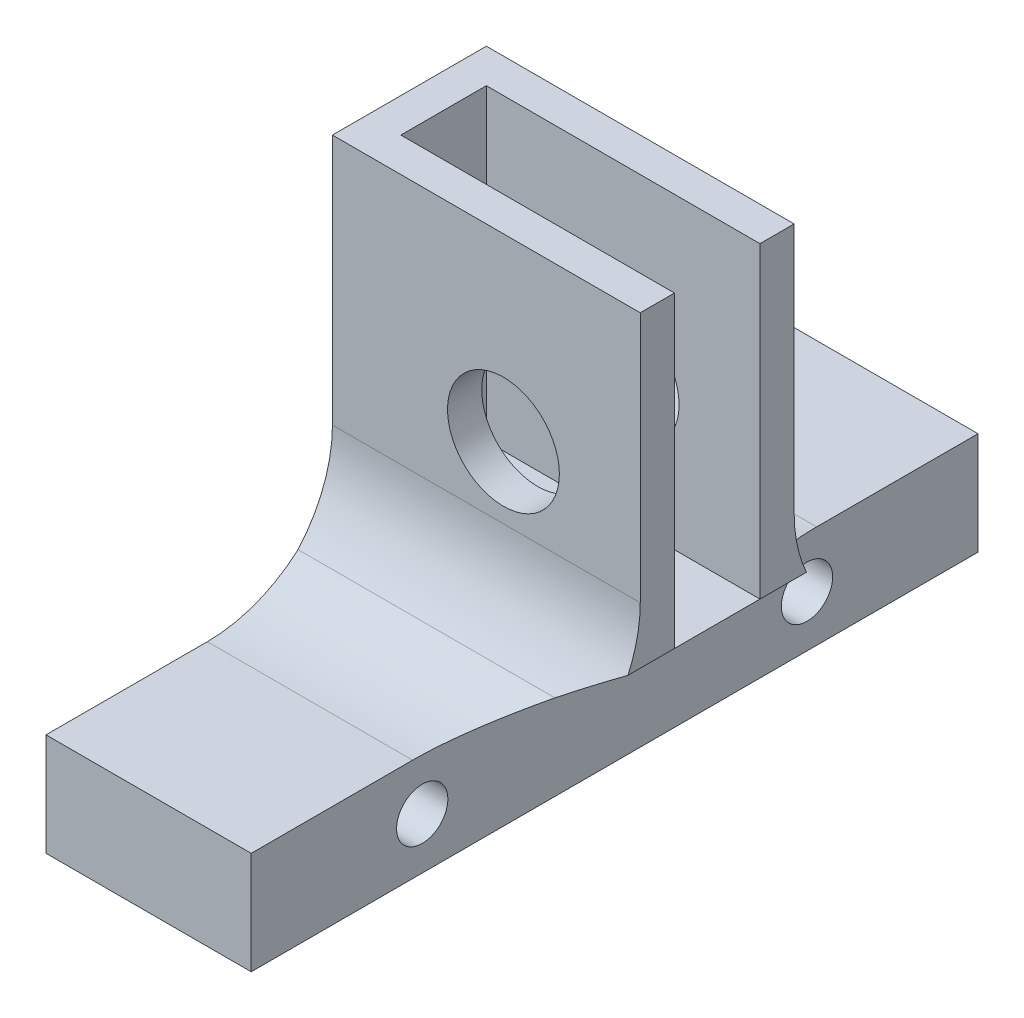
ISO-10303-21;
HEADER;
FILE_DESCRIPTION(('STEP AP214'),'2;1');
FILE_NAME('part.step','',(''),(''),'','','');
FILE_SCHEMA(('AUTOMOTIVE_DESIGN { 1 0 10303 214 1 1 1 1 }'));
ENDSEC;
DATA;
#1=APPLICATION_CONTEXT('core data for automotive mechanical design processes');
#2=APPLICATION_PROTOCOL_DEFINITION('international standard','automotive_design',2000,#1);
#3=PRODUCT_CONTEXT('',#1,'mechanical');
#4=PRODUCT('Part','Part','',(#3));
#5=PRODUCT_RELATED_PRODUCT_CATEGORY('part','',(#4));
#6=PRODUCT_DEFINITION_FORMATION('','',#4);
#7=PRODUCT_DEFINITION_CONTEXT('part definition',#1,'design');
#8=PRODUCT_DEFINITION('design','',#6,#7);
#9=PRODUCT_DEFINITION_SHAPE('','',#8);
#10=(LENGTH_UNIT() NAMED_UNIT(*) SI_UNIT(.MILLI.,.METRE.));
#11=(NAMED_UNIT(*) PLANE_ANGLE_UNIT() SI_UNIT($,.RADIAN.));
#12=(NAMED_UNIT(*) SI_UNIT($,.STERADIAN.) SOLID_ANGLE_UNIT());
#13=UNCERTAINTY_MEASURE_WITH_UNIT(LENGTH_MEASURE(1.E-05),#10,'distance_accuracy_value','');
#14=(GEOMETRIC_REPRESENTATION_CONTEXT(3) GLOBAL_UNCERTAINTY_ASSIGNED_CONTEXT((#13)) GLOBAL_UNIT_ASSIGNED_CONTEXT((#10,
#11,#12)) REPRESENTATION_CONTEXT('',''));
#15=CARTESIAN_POINT('',(0.,0.,0.));
#16=DIRECTION('',(0.,0.,1.));
#17=DIRECTION('',(1.,0.,0.));
#18=AXIS2_PLACEMENT_3D('',#15,#16,#17);
#19=CARTESIAN_POINT('',(-1.38451015917074,46.2203987008431,-42.5));
#20=DIRECTION('',(0.,-1.,0.));
#21=DIRECTION('',(0.,0.,-1.));
#22=AXIS2_PLACEMENT_3D('',#19,#20,#21);
#23=PLANE('',#22);
#24=DIRECTION('',(-1.,0.,0.));
#25=VECTOR('',#24,1.);
#26=CARTESIAN_POINT('',(30.6154898408293,46.2203987008431,-18.75));
#27=LINE('',#26,#25);
#28=CARTESIAN_POINT('',(30.6154898408293,46.2203987008431,-18.75));
#29=VERTEX_POINT('',#28);
#30=CARTESIAN_POINT('',(14.6154898408293,46.2203987008431,-18.75));
#31=VERTEX_POINT('',#30);
#32=EDGE_CURVE('E290',#29,#31,#27,.T.);
#33=ORIENTED_EDGE('',*,*,#32,.F.);
#34=DIRECTION('',(0.,0.,1.));
#35=VECTOR('',#34,1.);
#36=CARTESIAN_POINT('',(30.6154898408293,46.2203987008431,-42.5));
#37=LINE('',#36,#35);
#38=CARTESIAN_POINT('',(30.6154898408293,46.2203987008431,-23.75));
#39=VERTEX_POINT('',#38);
#40=EDGE_CURVE('E319',#39,#29,#37,.T.);
#41=ORIENTED_EDGE('',*,*,#40,.F.);
#42=DIRECTION('',(1.,0.,0.));
#43=VECTOR('',#42,1.);
#44=CARTESIAN_POINT('',(30.6154898408293,46.2203987008431,-23.75));
#45=LINE('',#44,#43);
#46=CARTESIAN_POINT('',(14.6154898408293,46.2203987008431,-23.75));
#47=VERTEX_POINT('',#46);
#48=EDGE_CURVE('E283',#47,#39,#45,.T.);
#49=ORIENTED_EDGE('',*,*,#48,.F.);
#50=DIRECTION('',(0.,0.,-1.));
#51=VECTOR('',#50,1.);
#52=CARTESIAN_POINT('',(14.6154898408293,46.2203987008431,-23.75));
#53=LINE('',#52,#51);
#54=EDGE_CURVE('E287',#31,#47,#53,.T.);
#55=ORIENTED_EDGE('',*,*,#54,.F.);
#56=EDGE_LOOP('',(#33,#41,#49,#55));
#57=FACE_BOUND('',#56,.T.);
#58=ADVANCED_FACE('F34',(#57),#23,.F.);
#59=CARTESIAN_POINT('',(24.6154898408293,42.2203987008431,-42.5));
#60=DIRECTION('',(-1.,0.,0.));
#61=DIRECTION('',(0.,0.,1.));
#62=AXIS2_PLACEMENT_3D('',#59,#60,#61);
#63=PLANE('',#62);
#64=CARTESIAN_POINT('',(24.6154898408293,39.2203987008431,-10.));
#65=DIRECTION('',(1.,0.,0.));
#66=DIRECTION('',(0.,0.,-1.));
#67=AXIS2_PLACEMENT_3D('',#64,#65,#66);
#68=CIRCLE('',#67,1.49999999999999);
#69=CARTESIAN_POINT('',(24.6154898408293,39.2203987008431,-11.5));
#70=VERTEX_POINT('',#69);
#71=EDGE_CURVE('E256',#70,#70,#68,.T.);
#72=ORIENTED_EDGE('',*,*,#71,.F.);
#73=EDGE_LOOP('',(#72));
#74=FACE_BOUND('',#73,.T.);
#75=CARTESIAN_POINT('',(24.6154898408293,39.2203987008431,-32.5));
#76=DIRECTION('',(1.,0.,0.));
#77=DIRECTION('',(0.,0.,-1.));
#78=AXIS2_PLACEMENT_3D('',#75,#76,#77);
#79=CIRCLE('',#78,1.49999999999999);
#80=CARTESIAN_POINT('',(24.6154898408293,39.2203987008431,-34.));
#81=VERTEX_POINT('',#80);
#82=EDGE_CURVE('E250',#81,#81,#79,.T.);
#83=ORIENTED_EDGE('',*,*,#82,.F.);
#84=EDGE_LOOP('',(#83));
#85=FACE_BOUND('',#84,.T.);
#86=DIRECTION('',(0.,-1.,0.));
#87=VECTOR('',#86,1.);
#88=CARTESIAN_POINT('',(24.6154898408293,42.2203987008431,0.));
#89=LINE('',#88,#87);
#90=CARTESIAN_POINT('',(24.6154898408293,42.2203987008431,0.));
#91=VERTEX_POINT('',#90);
#92=CARTESIAN_POINT('',(24.6154898408293,36.2203987008431,0.));
#93=VERTEX_POINT('',#92);
#94=EDGE_CURVE('E189',#91,#93,#89,.T.);
#95=ORIENTED_EDGE('',*,*,#94,.T.);
#96=DIRECTION('',(0.,0.,1.));
#97=VECTOR('',#96,1.);
#98=CARTESIAN_POINT('',(24.6154898408293,36.2203987008431,-42.5));
#99=LINE('',#98,#97);
#100=CARTESIAN_POINT('',(24.6154898408293,36.2203987008431,-42.5));
#101=VERTEX_POINT('',#100);
#102=EDGE_CURVE('E183',#101,#93,#99,.T.);
#103=ORIENTED_EDGE('',*,*,#102,.F.);
#104=DIRECTION('',(0.,-1.,0.));
#105=VECTOR('',#104,1.);
#106=CARTESIAN_POINT('',(24.6154898408293,42.2203987008431,-42.5));
#107=LINE('',#106,#105);
#108=CARTESIAN_POINT('',(24.6154898408293,42.2203987008431,-42.5));
#109=VERTEX_POINT('',#108);
#110=EDGE_CURVE('E185',#109,#101,#107,.T.);
#111=ORIENTED_EDGE('',*,*,#110,.F.);
#112=DIRECTION('',(0.,0.,1.));
#113=VECTOR('',#112,1.);
#114=CARTESIAN_POINT('',(24.6154898408293,42.2203987008431,-42.5));
#115=LINE('',#114,#113);
#116=CARTESIAN_POINT('',(24.6154898408293,42.2203987008431,-33.0637084989848));
#117=VERTEX_POINT('',#116);
#118=EDGE_CURVE('E172',#109,#117,#115,.T.);
#119=ORIENTED_EDGE('',*,*,#118,.T.);
#120=CARTESIAN_POINT('',(24.6154898408293,42.2203987008431,-9.43629150101523));
#121=VERTEX_POINT('',#120);
#122=EDGE_CURVE('E65',#117,#121,#115,.T.);
#123=ORIENTED_EDGE('',*,*,#122,.T.);
#124=EDGE_CURVE('E199',#121,#91,#115,.T.);
#125=ORIENTED_EDGE('',*,*,#124,.T.);
#126=EDGE_LOOP('',(#95,#103,#111,#119,#123,#125));
#127=FACE_BOUND('',#126,.T.);
#128=ADVANCED_FACE('F245',(#74,#85,#127),#63,.F.);
#129=CARTESIAN_POINT('',(24.6154898408293,36.2203987008431,-42.5));
#130=DIRECTION('',(0.,1.,0.));
#131=DIRECTION('',(0.,0.,1.));
#132=AXIS2_PLACEMENT_3D('',#129,#130,#131);
#133=PLANE('',#132);
#134=DIRECTION('',(-1.,0.,0.));
#135=VECTOR('',#134,1.);
#136=CARTESIAN_POINT('',(24.6154898408293,36.2203987008431,0.));
#137=LINE('',#136,#135);
#138=CARTESIAN_POINT('',(12.6154898408293,36.2203987008431,0.));
#139=VERTEX_POINT('',#138);
#140=EDGE_CURVE('E191',#93,#139,#137,.T.);
#141=ORIENTED_EDGE('',*,*,#140,.T.);
#142=DIRECTION('',(0.,0.,1.));
#143=VECTOR('',#142,1.);
#144=CARTESIAN_POINT('',(12.6154898408293,36.2203987008431,-42.5));
#145=LINE('',#144,#143);
#146=CARTESIAN_POINT('',(12.6154898408293,36.2203987008431,-42.5));
#147=VERTEX_POINT('',#146);
#148=EDGE_CURVE('E181',#147,#139,#145,.T.);
#149=ORIENTED_EDGE('',*,*,#148,.F.);
#150=DIRECTION('',(-1.,0.,0.));
#151=VECTOR('',#150,1.);
#152=CARTESIAN_POINT('',(24.6154898408293,36.2203987008431,-42.5));
#153=LINE('',#152,#151);
#154=EDGE_CURVE('E179',#101,#147,#153,.T.);
#155=ORIENTED_EDGE('',*,*,#154,.F.);
#156=ORIENTED_EDGE('',*,*,#102,.T.);
#157=EDGE_LOOP('',(#141,#149,#155,#156));
#158=FACE_BOUND('',#157,.T.);
#159=ADVANCED_FACE('F336',(#158),#133,.F.);
#160=CARTESIAN_POINT('',(12.6154898408293,36.2203987008431,-42.5));
#161=DIRECTION('',(1.,0.,0.));
#162=DIRECTION('',(0.,0.,-1.));
#163=AXIS2_PLACEMENT_3D('',#160,#161,#162);
#164=PLANE('',#163);
#165=CARTESIAN_POINT('',(12.6154898408293,39.2203987008431,-10.));
#166=DIRECTION('',(1.,0.,0.));
#167=DIRECTION('',(0.,0.,-1.));
#168=AXIS2_PLACEMENT_3D('',#165,#166,#167);
#169=CIRCLE('',#168,1.49999999999999);
#170=CARTESIAN_POINT('',(12.6154898408293,39.2203987008431,-11.5));
#171=VERTEX_POINT('',#170);
#172=EDGE_CURVE('E253',#171,#171,#169,.T.);
#173=ORIENTED_EDGE('',*,*,#172,.T.);
#174=EDGE_LOOP('',(#173));
#175=FACE_BOUND('',#174,.T.);
#176=CARTESIAN_POINT('',(12.6154898408293,39.2203987008431,-32.5));
#177=DIRECTION('',(1.,0.,0.));
#178=DIRECTION('',(0.,0.,-1.));
#179=AXIS2_PLACEMENT_3D('',#176,#177,#178);
#180=CIRCLE('',#179,1.49999999999999);
#181=CARTESIAN_POINT('',(12.6154898408293,39.2203987008431,-34.));
#182=VERTEX_POINT('',#181);
#183=EDGE_CURVE('E192',#182,#182,#180,.T.);
#184=ORIENTED_EDGE('',*,*,#183,.T.);
#185=EDGE_LOOP('',(#184));
#186=FACE_BOUND('',#185,.T.);
#187=CARTESIAN_POINT('',(12.6154898408293,49.5341071998279,-33.75));
#188=DIRECTION('',(1.,0.,0.));
#189=DIRECTION('',(0.,0.,-1.));
#190=AXIS2_PLACEMENT_3D('',#187,#188,#189);
#191=CIRCLE('',#190,8.);
#192=CARTESIAN_POINT('',(12.6154898408293,49.5341071998279,-25.75));
#193=VERTEX_POINT('',#192);
#194=CARTESIAN_POINT('',(12.6154898408293,44.2308159327191,-27.760417231876));
#195=VERTEX_POINT('',#194);
#196=EDGE_CURVE('E228',#193,#195,#191,.T.);
#197=ORIENTED_EDGE('',*,*,#196,.T.);
#198=CARTESIAN_POINT('',(12.6154898408293,50.2203987008431,-33.0637084989848));
#199=DIRECTION('',(1.,0.,0.));
#200=DIRECTION('',(0.,0.,-1.));
#201=AXIS2_PLACEMENT_3D('',#198,#199,#200);
#202=CIRCLE('',#201,8.);
#203=CARTESIAN_POINT('',(12.6154898408293,42.2203987008431,-33.0637084989848));
#204=VERTEX_POINT('',#203);
#205=EDGE_CURVE('E12',#195,#204,#202,.T.);
#206=ORIENTED_EDGE('',*,*,#205,.T.);
#207=DIRECTION('',(0.,0.,-1.));
#208=VECTOR('',#207,1.);
#209=CARTESIAN_POINT('',(12.6154898408293,42.2203987008431,-29.75));
#210=LINE('',#209,#208);
#211=CARTESIAN_POINT('',(12.6154898408293,42.2203987008431,-42.5));
#212=VERTEX_POINT('',#211);
#213=EDGE_CURVE('E157',#204,#212,#210,.T.);
#214=ORIENTED_EDGE('',*,*,#213,.T.);
#215=DIRECTION('',(0.,1.,0.));
#216=VECTOR('',#215,1.);
#217=CARTESIAN_POINT('',(12.6154898408293,36.2203987008431,-42.5));
#218=LINE('',#217,#216);
#219=EDGE_CURVE('E162',#147,#212,#218,.T.);
#220=ORIENTED_EDGE('',*,*,#219,.F.);
#221=ORIENTED_EDGE('',*,*,#148,.T.);
#222=DIRECTION('',(0.,1.,0.));
#223=VECTOR('',#222,1.);
#224=CARTESIAN_POINT('',(12.6154898408293,36.2203987008431,0.));
#225=LINE('',#224,#223);
#226=CARTESIAN_POINT('',(12.6154898408293,42.2203987008431,0.));
#227=VERTEX_POINT('',#226);
#228=EDGE_CURVE('E194',#139,#227,#225,.T.);
#229=ORIENTED_EDGE('',*,*,#228,.T.);
#230=DIRECTION('',(0.,0.,-1.));
#231=VECTOR('',#230,1.);
#232=CARTESIAN_POINT('',(12.6154898408293,42.2203987008431,-12.75));
#233=LINE('',#232,#231);
#234=CARTESIAN_POINT('',(12.6154898408293,42.2203987008431,-9.43629150101523));
#235=VERTEX_POINT('',#234);
#236=EDGE_CURVE('E175',#227,#235,#233,.T.);
#237=ORIENTED_EDGE('',*,*,#236,.T.);
#238=CARTESIAN_POINT('',(12.6154898408293,50.2203987008431,-9.43629150101523));
#239=DIRECTION('',(1.,0.,0.));
#240=DIRECTION('',(0.,0.,-1.));
#241=AXIS2_PLACEMENT_3D('',#238,#239,#240);
#242=CIRCLE('',#241,8.);
#243=CARTESIAN_POINT('',(12.6154898408293,44.2308159327191,-14.739582768124));
#244=VERTEX_POINT('',#243);
#245=EDGE_CURVE('E219',#235,#244,#242,.T.);
#246=ORIENTED_EDGE('',*,*,#245,.T.);
#247=CARTESIAN_POINT('',(12.6154898408293,49.5341071998279,-8.75000000000001));
#248=DIRECTION('',(1.,0.,0.));
#249=DIRECTION('',(0.,0.,-1.));
#250=AXIS2_PLACEMENT_3D('',#247,#248,#249);
#251=CIRCLE('',#250,8.);
#252=CARTESIAN_POINT('',(12.6154898408293,49.5341071998279,-16.75));
#253=VERTEX_POINT('',#252);
#254=EDGE_CURVE('E226',#244,#253,#251,.T.);
#255=ORIENTED_EDGE('',*,*,#254,.T.);
#256=DIRECTION('',(0.,-1.,0.));
#257=VECTOR('',#256,1.);
#258=CARTESIAN_POINT('',(12.6154898408293,64.2203987008431,-16.75));
#259=LINE('',#258,#257);
#260=CARTESIAN_POINT('',(12.6154898408293,64.2203987008431,-16.75));
#261=VERTEX_POINT('',#260);
#262=EDGE_CURVE('E265',#261,#253,#259,.T.);
#263=ORIENTED_EDGE('',*,*,#262,.F.);
#264=DIRECTION('',(0.,0.,1.));
#265=VECTOR('',#264,1.);
#266=CARTESIAN_POINT('',(12.6154898408293,64.2203987008431,-25.75));
#267=LINE('',#266,#265);
#268=CARTESIAN_POINT('',(12.6154898408293,64.2203987008431,-25.75));
#269=VERTEX_POINT('',#268);
#270=EDGE_CURVE('E307',#269,#261,#267,.T.);
#271=ORIENTED_EDGE('',*,*,#270,.F.);
#272=DIRECTION('',(0.,-1.,0.));
#273=VECTOR('',#272,1.);
#274=CARTESIAN_POINT('',(12.6154898408293,64.2203987008431,-25.75));
#275=LINE('',#274,#273);
#276=EDGE_CURVE('E262',#269,#193,#275,.T.);
#277=ORIENTED_EDGE('',*,*,#276,.T.);
#278=EDGE_LOOP('',(#197,#206,#214,#220,#221,#229,#237,#246,#255,#263,#271,#277));
#279=FACE_BOUND('',#278,.T.);
#280=ADVANCED_FACE('F159',(#175,#186,#279),#164,.F.);
#281=CARTESIAN_POINT('',(0.,0.,-42.5));
#282=DIRECTION('',(0.,0.,-1.));
#283=DIRECTION('',(-1.,0.,0.));
#284=AXIS2_PLACEMENT_3D('',#281,#282,#283);
#285=PLANE('',#284);
#286=DIRECTION('',(1.,0.,0.));
#287=VECTOR('',#286,1.);
#288=CARTESIAN_POINT('',(12.6154898408293,42.2203987008431,-42.5));
#289=LINE('',#288,#287);
#290=EDGE_CURVE('E167',#212,#109,#289,.T.);
#291=ORIENTED_EDGE('',*,*,#290,.T.);
#292=ORIENTED_EDGE('',*,*,#110,.T.);
#293=ORIENTED_EDGE('',*,*,#154,.T.);
#294=ORIENTED_EDGE('',*,*,#219,.T.);
#295=EDGE_LOOP('',(#291,#292,#293,#294));
#296=FACE_BOUND('',#295,.T.);
#297=ADVANCED_FACE('F177',(#296),#285,.T.);
#298=CARTESIAN_POINT('',(0.,0.,0.));
#299=DIRECTION('',(0.,0.,-1.));
#300=DIRECTION('',(-1.,0.,0.));
#301=AXIS2_PLACEMENT_3D('',#298,#299,#300);
#302=PLANE('',#301);
#303=ORIENTED_EDGE('',*,*,#94,.F.);
#304=DIRECTION('',(1.,0.,0.));
#305=VECTOR('',#304,1.);
#306=CARTESIAN_POINT('',(12.6154898408293,42.2203987008431,0.));
#307=LINE('',#306,#305);
#308=EDGE_CURVE('E321',#227,#91,#307,.T.);
#309=ORIENTED_EDGE('',*,*,#308,.F.);
#310=ORIENTED_EDGE('',*,*,#228,.F.);
#311=ORIENTED_EDGE('',*,*,#140,.F.);
#312=EDGE_LOOP('',(#303,#309,#310,#311));
#313=FACE_BOUND('',#312,.T.);
#314=ADVANCED_FACE('F333',(#313),#302,.F.);
#315=CARTESIAN_POINT('',(24.6154898408293,39.2203987008431,-32.5));
#316=DIRECTION('',(1.,0.,0.));
#317=DIRECTION('',(0.,0.,-1.));
#318=AXIS2_PLACEMENT_3D('',#315,#316,#317);
#319=CYLINDRICAL_SURFACE('',#318,1.49999999999999);
#320=ORIENTED_EDGE('',*,*,#82,.T.);
#321=EDGE_LOOP('',(#320));
#322=FACE_BOUND('',#321,.T.);
#323=ORIENTED_EDGE('',*,*,#183,.F.);
#324=EDGE_LOOP('',(#323));
#325=FACE_BOUND('',#324,.T.);
#326=ADVANCED_FACE('F480',(#322,#325),#319,.F.);
#327=CARTESIAN_POINT('',(24.6154898408293,39.2203987008431,-10.));
#328=DIRECTION('',(1.,0.,0.));
#329=DIRECTION('',(0.,0.,-1.));
#330=AXIS2_PLACEMENT_3D('',#327,#328,#329);
#331=CYLINDRICAL_SURFACE('',#330,1.49999999999999);
#332=ORIENTED_EDGE('',*,*,#71,.T.);
#333=EDGE_LOOP('',(#332));
#334=FACE_BOUND('',#333,.T.);
#335=ORIENTED_EDGE('',*,*,#172,.F.);
#336=EDGE_LOOP('',(#335));
#337=FACE_BOUND('',#336,.T.);
#338=ADVANCED_FACE('F473',(#334,#337),#331,.F.);
#339=CARTESIAN_POINT('',(30.6154898408293,64.2203987008431,-23.75));
#340=DIRECTION('',(-1.,0.,0.));
#341=DIRECTION('',(0.,0.,1.));
#342=AXIS2_PLACEMENT_3D('',#339,#340,#341);
#343=PLANE('',#342);
#344=DIRECTION('',(0.,0.,-1.));
#345=VECTOR('',#344,1.);
#346=CARTESIAN_POINT('',(30.6154898408293,46.2203987008431,-23.75));
#347=LINE('',#346,#345);
#348=CARTESIAN_POINT('',(30.6154898408293,46.2203987008431,-26.4685622310044));
#349=VERTEX_POINT('',#348);
#350=EDGE_CURVE('E53',#39,#349,#347,.T.);
#351=ORIENTED_EDGE('',*,*,#350,.T.);
#352=CARTESIAN_POINT('',(30.6154898408293,49.5341071998279,-33.75));
#353=DIRECTION('',(-1.,0.,0.));
#354=DIRECTION('',(0.,0.,1.));
#355=AXIS2_PLACEMENT_3D('',#352,#353,#354);
#356=CIRCLE('',#355,8.);
#357=CARTESIAN_POINT('',(30.6154898408293,49.5341071998279,-25.75));
#358=VERTEX_POINT('',#357);
#359=EDGE_CURVE('E232',#349,#358,#356,.T.);
#360=ORIENTED_EDGE('',*,*,#359,.T.);
#361=DIRECTION('',(0.,-1.,0.));
#362=VECTOR('',#361,1.);
#363=CARTESIAN_POINT('',(30.6154898408293,64.2203987008431,-25.75));
#364=LINE('',#363,#362);
#365=CARTESIAN_POINT('',(30.6154898408293,64.2203987008431,-25.75));
#366=VERTEX_POINT('',#365);
#367=EDGE_CURVE('E259',#366,#358,#364,.T.);
#368=ORIENTED_EDGE('',*,*,#367,.F.);
#369=DIRECTION('',(0.,0.,-1.));
#370=VECTOR('',#369,1.);
#371=CARTESIAN_POINT('',(30.6154898408293,64.2203987008431,-23.75));
#372=LINE('',#371,#370);
#373=CARTESIAN_POINT('',(30.6154898408293,64.2203987008431,-23.75));
#374=VERTEX_POINT('',#373);
#375=EDGE_CURVE('E286',#374,#366,#372,.T.);
#376=ORIENTED_EDGE('',*,*,#375,.F.);
#377=DIRECTION('',(0.,-1.,0.));
#378=VECTOR('',#377,1.);
#379=CARTESIAN_POINT('',(30.6154898408293,64.2203987008431,-23.75));
#380=LINE('',#379,#378);
#381=EDGE_CURVE('E280',#374,#39,#380,.T.);
#382=ORIENTED_EDGE('',*,*,#381,.T.);
#383=EDGE_LOOP('',(#351,#360,#368,#376,#382));
#384=FACE_BOUND('',#383,.T.);
#385=ADVANCED_FACE('F465',(#384),#343,.F.);
#386=CARTESIAN_POINT('',(30.6154898408293,64.2203987008431,-25.75));
#387=DIRECTION('',(0.,0.,1.));
#388=DIRECTION('',(1.,0.,0.));
#389=AXIS2_PLACEMENT_3D('',#386,#387,#388);
#390=PLANE('',#389);
#391=CARTESIAN_POINT('',(22.6154898408293,53.6903987008431,-25.75));
#392=DIRECTION('',(0.,0.,1.));
#393=DIRECTION('',(1.,0.,0.));
#394=AXIS2_PLACEMENT_3D('',#391,#392,#393);
#395=CIRCLE('',#394,3.27);
#396=CARTESIAN_POINT('',(25.8854898408293,53.6903987008431,-25.75));
#397=VERTEX_POINT('',#396);
#398=EDGE_CURVE('E297',#397,#397,#395,.T.);
#399=ORIENTED_EDGE('',*,*,#398,.T.);
#400=EDGE_LOOP('',(#399));
#401=FACE_BOUND('',#400,.T.);
#402=ORIENTED_EDGE('',*,*,#367,.T.);
#403=DIRECTION('',(-1.,0.,0.));
#404=VECTOR('',#403,1.);
#405=CARTESIAN_POINT('',(12.6154898408293,49.5341071998279,-25.75));
#406=LINE('',#405,#404);
#407=EDGE_CURVE('E211',#358,#193,#406,.T.);
#408=ORIENTED_EDGE('',*,*,#407,.T.);
#409=ORIENTED_EDGE('',*,*,#276,.F.);
#410=DIRECTION('',(-1.,0.,0.));
#411=VECTOR('',#410,1.);
#412=CARTESIAN_POINT('',(30.6154898408293,64.2203987008431,-25.75));
#413=LINE('',#412,#411);
#414=EDGE_CURVE('E309',#366,#269,#413,.T.);
#415=ORIENTED_EDGE('',*,*,#414,.F.);
#416=EDGE_LOOP('',(#402,#408,#409,#415));
#417=FACE_BOUND('',#416,.T.);
#418=ADVANCED_FACE('F457',(#401,#417),#390,.F.);
#419=CARTESIAN_POINT('',(30.6154898408293,64.2203987008431,-16.75));
#420=DIRECTION('',(0.,0.,-1.));
#421=DIRECTION('',(-1.,0.,0.));
#422=AXIS2_PLACEMENT_3D('',#419,#420,#421);
#423=PLANE('',#422);
#424=CARTESIAN_POINT('',(22.6154898408293,53.6903987008431,-16.75));
#425=DIRECTION('',(0.,0.,1.));
#426=DIRECTION('',(1.,0.,0.));
#427=AXIS2_PLACEMENT_3D('',#424,#425,#426);
#428=CIRCLE('',#427,3.27);
#429=CARTESIAN_POINT('',(25.8854898408293,53.6903987008431,-16.75));
#430=VERTEX_POINT('',#429);
#431=EDGE_CURVE('E206',#430,#430,#428,.T.);
#432=ORIENTED_EDGE('',*,*,#431,.F.);
#433=EDGE_LOOP('',(#432));
#434=FACE_BOUND('',#433,.T.);
#435=ORIENTED_EDGE('',*,*,#262,.T.);
#436=DIRECTION('',(1.,0.,0.));
#437=VECTOR('',#436,1.);
#438=CARTESIAN_POINT('',(30.6154898408293,49.5341071998279,-16.75));
#439=LINE('',#438,#437);
#440=CARTESIAN_POINT('',(30.6154898408293,49.5341071998279,-16.75));
#441=VERTEX_POINT('',#440);
#442=EDGE_CURVE('E209',#253,#441,#439,.T.);
#443=ORIENTED_EDGE('',*,*,#442,.T.);
#444=DIRECTION('',(0.,-1.,0.));
#445=VECTOR('',#444,1.);
#446=CARTESIAN_POINT('',(30.6154898408293,64.2203987008431,-16.75));
#447=LINE('',#446,#445);
#448=CARTESIAN_POINT('',(30.6154898408293,64.2203987008431,-16.75));
#449=VERTEX_POINT('',#448);
#450=EDGE_CURVE('E268',#449,#441,#447,.T.);
#451=ORIENTED_EDGE('',*,*,#450,.F.);
#452=DIRECTION('',(1.,0.,0.));
#453=VECTOR('',#452,1.);
#454=CARTESIAN_POINT('',(30.6154898408293,64.2203987008431,-16.75));
#455=LINE('',#454,#453);
#456=EDGE_CURVE('E305',#261,#449,#455,.T.);
#457=ORIENTED_EDGE('',*,*,#456,.F.);
#458=EDGE_LOOP('',(#435,#443,#451,#457));
#459=FACE_BOUND('',#458,.T.);
#460=ADVANCED_FACE('F449',(#434,#459),#423,.F.);
#461=CARTESIAN_POINT('',(30.6154898408293,64.2203987008431,-18.75));
#462=DIRECTION('',(-1.,0.,0.));
#463=DIRECTION('',(0.,0.,1.));
#464=AXIS2_PLACEMENT_3D('',#461,#462,#463);
#465=PLANE('',#464);
#466=DIRECTION('',(0.,0.,-1.));
#467=VECTOR('',#466,1.);
#468=CARTESIAN_POINT('',(30.6154898408293,46.2203987008431,-18.75));
#469=LINE('',#468,#467);
#470=CARTESIAN_POINT('',(30.6154898408293,46.2203987008431,-16.0314377689956));
#471=VERTEX_POINT('',#470);
#472=EDGE_CURVE('E293',#471,#29,#469,.T.);
#473=ORIENTED_EDGE('',*,*,#472,.T.);
#474=DIRECTION('',(0.,-1.,0.));
#475=VECTOR('',#474,1.);
#476=CARTESIAN_POINT('',(30.6154898408293,64.2203987008431,-18.75));
#477=LINE('',#476,#475);
#478=CARTESIAN_POINT('',(30.6154898408293,64.2203987008431,-18.75));
#479=VERTEX_POINT('',#478);
#480=EDGE_CURVE('E271',#479,#29,#477,.T.);
#481=ORIENTED_EDGE('',*,*,#480,.F.);
#482=DIRECTION('',(0.,0.,-1.));
#483=VECTOR('',#482,1.);
#484=CARTESIAN_POINT('',(30.6154898408293,64.2203987008431,-18.75));
#485=LINE('',#484,#483);
#486=EDGE_CURVE('E303',#449,#479,#485,.T.);
#487=ORIENTED_EDGE('',*,*,#486,.F.);
#488=ORIENTED_EDGE('',*,*,#450,.T.);
#489=CARTESIAN_POINT('',(30.6154898408293,49.5341071998279,-8.75000000000001));
#490=DIRECTION('',(-1.,0.,0.));
#491=DIRECTION('',(0.,0.,1.));
#492=AXIS2_PLACEMENT_3D('',#489,#490,#491);
#493=CIRCLE('',#492,8.);
#494=EDGE_CURVE('E221',#441,#471,#493,.T.);
#495=ORIENTED_EDGE('',*,*,#494,.T.);
#496=EDGE_LOOP('',(#473,#481,#487,#488,#495));
#497=FACE_BOUND('',#496,.T.);
#498=ADVANCED_FACE('F442',(#497),#465,.F.);
#499=CARTESIAN_POINT('',(30.6154898408293,64.2203987008431,-18.75));
#500=DIRECTION('',(0.,0.,1.));
#501=DIRECTION('',(1.,0.,0.));
#502=AXIS2_PLACEMENT_3D('',#499,#500,#501);
#503=PLANE('',#502);
#504=CARTESIAN_POINT('',(22.6154898408293,53.6903987008431,-18.75));
#505=DIRECTION('',(0.,0.,1.));
#506=DIRECTION('',(1.,0.,0.));
#507=AXIS2_PLACEMENT_3D('',#504,#505,#506);
#508=CIRCLE('',#507,3.27);
#509=CARTESIAN_POINT('',(25.8854898408293,53.6903987008431,-18.75));
#510=VERTEX_POINT('',#509);
#511=EDGE_CURVE('E205',#510,#510,#508,.T.);
#512=ORIENTED_EDGE('',*,*,#511,.T.);
#513=EDGE_LOOP('',(#512));
#514=FACE_BOUND('',#513,.T.);
#515=ORIENTED_EDGE('',*,*,#32,.T.);
#516=DIRECTION('',(0.,-1.,0.));
#517=VECTOR('',#516,1.);
#518=CARTESIAN_POINT('',(14.6154898408293,64.2203987008431,-18.75));
#519=LINE('',#518,#517);
#520=CARTESIAN_POINT('',(14.6154898408293,64.2203987008431,-18.75));
#521=VERTEX_POINT('',#520);
#522=EDGE_CURVE('E274',#521,#31,#519,.T.);
#523=ORIENTED_EDGE('',*,*,#522,.F.);
#524=DIRECTION('',(-1.,0.,0.));
#525=VECTOR('',#524,1.);
#526=CARTESIAN_POINT('',(30.6154898408293,64.2203987008431,-18.75));
#527=LINE('',#526,#525);
#528=EDGE_CURVE('E301',#479,#521,#527,.T.);
#529=ORIENTED_EDGE('',*,*,#528,.F.);
#530=ORIENTED_EDGE('',*,*,#480,.T.);
#531=EDGE_LOOP('',(#515,#523,#529,#530));
#532=FACE_BOUND('',#531,.T.);
#533=ADVANCED_FACE('F434',(#514,#532),#503,.F.);
#534=CARTESIAN_POINT('',(14.6154898408293,64.2203987008431,-23.75));
#535=DIRECTION('',(-1.,0.,0.));
#536=DIRECTION('',(0.,0.,1.));
#537=AXIS2_PLACEMENT_3D('',#534,#535,#536);
#538=PLANE('',#537);
#539=ORIENTED_EDGE('',*,*,#54,.T.);
#540=DIRECTION('',(0.,-1.,0.));
#541=VECTOR('',#540,1.);
#542=CARTESIAN_POINT('',(14.6154898408293,64.2203987008431,-23.75));
#543=LINE('',#542,#541);
#544=CARTESIAN_POINT('',(14.6154898408293,64.2203987008431,-23.75));
#545=VERTEX_POINT('',#544);
#546=EDGE_CURVE('E277',#545,#47,#543,.T.);
#547=ORIENTED_EDGE('',*,*,#546,.F.);
#548=DIRECTION('',(0.,0.,-1.));
#549=VECTOR('',#548,1.);
#550=CARTESIAN_POINT('',(14.6154898408293,64.2203987008431,-23.75));
#551=LINE('',#550,#549);
#552=EDGE_CURVE('E299',#521,#545,#551,.T.);
#553=ORIENTED_EDGE('',*,*,#552,.F.);
#554=ORIENTED_EDGE('',*,*,#522,.T.);
#555=EDGE_LOOP('',(#539,#547,#553,#554));
#556=FACE_BOUND('',#555,.T.);
#557=ADVANCED_FACE('F425',(#556),#538,.F.);
#558=CARTESIAN_POINT('',(30.6154898408293,64.2203987008431,-23.75));
#559=DIRECTION('',(0.,0.,-1.));
#560=DIRECTION('',(-1.,0.,0.));
#561=AXIS2_PLACEMENT_3D('',#558,#559,#560);
#562=PLANE('',#561);
#563=CARTESIAN_POINT('',(22.6154898408293,53.6903987008431,-23.75));
#564=DIRECTION('',(0.,0.,-1.));
#565=DIRECTION('',(-1.,0.,0.));
#566=AXIS2_PLACEMENT_3D('',#563,#564,#565);
#567=CIRCLE('',#566,3.27);
#568=CARTESIAN_POINT('',(25.8854898408293,53.6903987008431,-23.75));
#569=VERTEX_POINT('',#568);
#570=EDGE_CURVE('E202',#569,#569,#567,.T.);
#571=ORIENTED_EDGE('',*,*,#570,.T.);
#572=EDGE_LOOP('',(#571));
#573=FACE_BOUND('',#572,.T.);
#574=ORIENTED_EDGE('',*,*,#48,.T.);
#575=ORIENTED_EDGE('',*,*,#381,.F.);
#576=DIRECTION('',(1.,0.,0.));
#577=VECTOR('',#576,1.);
#578=CARTESIAN_POINT('',(30.6154898408293,64.2203987008431,-23.75));
#579=LINE('',#578,#577);
#580=EDGE_CURVE('E282',#545,#374,#579,.T.);
#581=ORIENTED_EDGE('',*,*,#580,.F.);
#582=ORIENTED_EDGE('',*,*,#546,.T.);
#583=EDGE_LOOP('',(#574,#575,#581,#582));
#584=FACE_BOUND('',#583,.T.);
#585=ADVANCED_FACE('F416',(#573,#584),#562,.F.);
#586=CARTESIAN_POINT('',(0.,64.2203987008431,0.));
#587=DIRECTION('',(0.,1.,0.));
#588=DIRECTION('',(0.,0.,1.));
#589=AXIS2_PLACEMENT_3D('',#586,#587,#588);
#590=PLANE('',#589);
#591=ORIENTED_EDGE('',*,*,#375,.T.);
#592=ORIENTED_EDGE('',*,*,#414,.T.);
#593=ORIENTED_EDGE('',*,*,#270,.T.);
#594=ORIENTED_EDGE('',*,*,#456,.T.);
#595=ORIENTED_EDGE('',*,*,#486,.T.);
#596=ORIENTED_EDGE('',*,*,#528,.T.);
#597=ORIENTED_EDGE('',*,*,#552,.T.);
#598=ORIENTED_EDGE('',*,*,#580,.T.);
#599=EDGE_LOOP('',(#591,#592,#593,#594,#595,#596,#597,#598));
#600=FACE_BOUND('',#599,.T.);
#601=ADVANCED_FACE('F409',(#600),#590,.T.);
#602=CARTESIAN_POINT('',(22.6154898408293,53.6903987008431,-42.5));
#603=DIRECTION('',(0.,0.,1.));
#604=DIRECTION('',(1.,0.,0.));
#605=AXIS2_PLACEMENT_3D('',#602,#603,#604);
#606=CYLINDRICAL_SURFACE('',#605,3.27);
#607=CARTESIAN_POINT('',(25.8854898408293,53.6903987008431,-23.75));
#608=CARTESIAN_POINT('',(25.8854898408293,53.6903987008431,-23.7708333333333));
#609=CARTESIAN_POINT('',(25.8854898408293,53.6903987008431,-23.7916666666667));
#610=CARTESIAN_POINT('',(25.8854898408293,53.6903987008431,-23.8333333333333));
#611=CARTESIAN_POINT('',(25.8854898408293,53.6903987008431,-23.8541666666667));
#612=CARTESIAN_POINT('',(25.8854898408293,53.6903987008431,-23.8958333333333));
#613=CARTESIAN_POINT('',(25.8854898408293,53.6903987008431,-23.9166666666667));
#614=CARTESIAN_POINT('',(25.8854898408293,53.6903987008431,-23.9583333333333));
#615=CARTESIAN_POINT('',(25.8854898408293,53.6903987008431,-23.9791666666667));
#616=CARTESIAN_POINT('',(25.8854898408293,53.6903987008431,-24.0208333333333));
#617=CARTESIAN_POINT('',(25.8854898408293,53.6903987008431,-24.0416666666667));
#618=CARTESIAN_POINT('',(25.8854898408293,53.6903987008431,-24.0833333333333));
#619=CARTESIAN_POINT('',(25.8854898408293,53.6903987008431,-24.1041666666667));
#620=CARTESIAN_POINT('',(25.8854898408293,53.6903987008431,-24.1458333333333));
#621=CARTESIAN_POINT('',(25.8854898408293,53.6903987008431,-24.1666666666667));
#622=CARTESIAN_POINT('',(25.8854898408293,53.6903987008431,-24.2083333333333));
#623=CARTESIAN_POINT('',(25.8854898408293,53.6903987008431,-24.2291666666667));
#624=CARTESIAN_POINT('',(25.8854898408293,53.6903987008431,-24.2708333333333));
#625=CARTESIAN_POINT('',(25.8854898408293,53.6903987008431,-24.2916666666667));
#626=CARTESIAN_POINT('',(25.8854898408293,53.6903987008431,-24.3333333333333));
#627=CARTESIAN_POINT('',(25.8854898408293,53.6903987008431,-24.3541666666667));
#628=CARTESIAN_POINT('',(25.8854898408293,53.6903987008431,-24.3958333333333));
#629=CARTESIAN_POINT('',(25.8854898408293,53.6903987008431,-24.4166666666667));
#630=CARTESIAN_POINT('',(25.8854898408293,53.6903987008431,-24.4583333333333));
#631=CARTESIAN_POINT('',(25.8854898408293,53.6903987008431,-24.4791666666667));
#632=CARTESIAN_POINT('',(25.8854898408293,53.6903987008431,-24.5208333333333));
#633=CARTESIAN_POINT('',(25.8854898408293,53.6903987008431,-24.5416666666667));
#634=CARTESIAN_POINT('',(25.8854898408293,53.6903987008431,-24.5833333333333));
#635=CARTESIAN_POINT('',(25.8854898408293,53.6903987008431,-24.6041666666667));
#636=CARTESIAN_POINT('',(25.8854898408293,53.6903987008431,-24.6458333333333));
#637=CARTESIAN_POINT('',(25.8854898408293,53.6903987008431,-24.6666666666667));
#638=CARTESIAN_POINT('',(25.8854898408293,53.6903987008431,-24.7083333333333));
#639=CARTESIAN_POINT('',(25.8854898408293,53.6903987008431,-24.7291666666667));
#640=CARTESIAN_POINT('',(25.8854898408293,53.6903987008431,-24.7708333333333));
#641=CARTESIAN_POINT('',(25.8854898408293,53.6903987008431,-24.7916666666667));
#642=CARTESIAN_POINT('',(25.8854898408293,53.6903987008431,-24.8333333333333));
#643=CARTESIAN_POINT('',(25.8854898408293,53.6903987008431,-24.8541666666667));
#644=CARTESIAN_POINT('',(25.8854898408293,53.6903987008431,-24.8958333333333));
#645=CARTESIAN_POINT('',(25.8854898408293,53.6903987008431,-24.9166666666667));
#646=CARTESIAN_POINT('',(25.8854898408293,53.6903987008431,-24.9583333333333));
#647=CARTESIAN_POINT('',(25.8854898408293,53.6903987008431,-24.9791666666667));
#648=CARTESIAN_POINT('',(25.8854898408293,53.6903987008431,-25.0208333333333));
#649=CARTESIAN_POINT('',(25.8854898408293,53.6903987008431,-25.0416666666667));
#650=CARTESIAN_POINT('',(25.8854898408293,53.6903987008431,-25.0833333333333));
#651=CARTESIAN_POINT('',(25.8854898408293,53.6903987008431,-25.1041666666667));
#652=CARTESIAN_POINT('',(25.8854898408293,53.6903987008431,-25.1458333333333));
#653=CARTESIAN_POINT('',(25.8854898408293,53.6903987008431,-25.1666666666667));
#654=CARTESIAN_POINT('',(25.8854898408293,53.6903987008431,-25.2083333333333));
#655=CARTESIAN_POINT('',(25.8854898408293,53.6903987008431,-25.2291666666667));
#656=CARTESIAN_POINT('',(25.8854898408293,53.6903987008431,-25.2708333333333));
#657=CARTESIAN_POINT('',(25.8854898408293,53.6903987008431,-25.2916666666667));
#658=CARTESIAN_POINT('',(25.8854898408293,53.6903987008431,-25.3333333333333));
#659=CARTESIAN_POINT('',(25.8854898408293,53.6903987008431,-25.3541666666667));
#660=CARTESIAN_POINT('',(25.8854898408293,53.6903987008431,-25.3958333333333));
#661=CARTESIAN_POINT('',(25.8854898408293,53.6903987008431,-25.4166666666667));
#662=CARTESIAN_POINT('',(25.8854898408293,53.6903987008431,-25.4583333333333));
#663=CARTESIAN_POINT('',(25.8854898408293,53.6903987008431,-25.4791666666667));
#664=CARTESIAN_POINT('',(25.8854898408293,53.6903987008431,-25.5208333333333));
#665=CARTESIAN_POINT('',(25.8854898408293,53.6903987008431,-25.5416666666667));
#666=CARTESIAN_POINT('',(25.8854898408293,53.6903987008431,-25.5833333333333));
#667=CARTESIAN_POINT('',(25.8854898408293,53.6903987008431,-25.6041666666667));
#668=CARTESIAN_POINT('',(25.8854898408293,53.6903987008431,-25.6458333333333));
#669=CARTESIAN_POINT('',(25.8854898408293,53.6903987008431,-25.6666666666667));
#670=CARTESIAN_POINT('',(25.8854898408293,53.6903987008431,-25.7083333333333));
#671=CARTESIAN_POINT('',(25.8854898408293,53.6903987008431,-25.7291666666667));
#672=CARTESIAN_POINT('',(25.8854898408293,53.6903987008431,-25.75));
#673=B_SPLINE_CURVE_WITH_KNOTS('',3,(#607,#608,#609,#610,#611,#612,#613,#614,#615,#616,#617,
#618,#619,#620,#621,#622,#623,#624,#625,#626,#627,#628,#629,#630,#631,#632,#633,#634,#635,#636,
#637,#638,#639,#640,#641,#642,#643,#644,#645,#646,#647,#648,#649,#650,#651,#652,#653,#654,#655,
#656,#657,#658,#659,#660,#661,#662,#663,#664,#665,#666,#667,#668,#669,#670,#671,#672),
.UNSPECIFIED.,.F.,.F.,(4,2,2,2,2,2,2,2,2,2,2,2,2,2,2,2,2,2,2,2,2,2,2,2,2,2,2,2,2,2,2,2,4),(0.,
0.0625000000000001,0.125,0.1875,0.25,0.3125,0.375,0.4375,0.5,0.5625,0.625000000000001,
0.687500000000001,0.750000000000001,0.812500000000001,0.875000000000001,0.937500000000001,1.,
1.0625,1.125,1.1875,1.25,1.3125,1.375,1.4375,1.5,1.5625,1.625,1.6875,1.75,1.8125,1.875,1.9375,
2.),.UNSPECIFIED.);
#674=EDGE_CURVE('BSEAM401',#569,#397,#673,.T.);
#675=ORIENTED_EDGE('',*,*,#570,.F.);
#676=ORIENTED_EDGE('',*,*,#398,.F.);
#677=ORIENTED_EDGE('',*,*,#674,.T.);
#678=ORIENTED_EDGE('',*,*,#674,.F.);
#679=EDGE_LOOP('',(#675,#677,#676,#678));
#680=FACE_BOUND('',#679,.T.);
#681=ADVANCED_FACE('F401',(#680),#606,.F.);
#682=CARTESIAN_POINT('',(25.8854898408293,53.6903987008431,-16.75));
#683=CARTESIAN_POINT('',(25.8854898408293,53.6903987008431,-16.7708333333333));
#684=CARTESIAN_POINT('',(25.8854898408293,53.6903987008431,-16.7916666666667));
#685=CARTESIAN_POINT('',(25.8854898408293,53.6903987008431,-16.8333333333333));
#686=CARTESIAN_POINT('',(25.8854898408293,53.6903987008431,-16.8541666666667));
#687=CARTESIAN_POINT('',(25.8854898408293,53.6903987008431,-16.8958333333333));
#688=CARTESIAN_POINT('',(25.8854898408293,53.6903987008431,-16.9166666666667));
#689=CARTESIAN_POINT('',(25.8854898408293,53.6903987008431,-16.9583333333333));
#690=CARTESIAN_POINT('',(25.8854898408293,53.6903987008431,-16.9791666666667));
#691=CARTESIAN_POINT('',(25.8854898408293,53.6903987008431,-17.0208333333333));
#692=CARTESIAN_POINT('',(25.8854898408293,53.6903987008431,-17.0416666666667));
#693=CARTESIAN_POINT('',(25.8854898408293,53.6903987008431,-17.0833333333333));
#694=CARTESIAN_POINT('',(25.8854898408293,53.6903987008431,-17.1041666666667));
#695=CARTESIAN_POINT('',(25.8854898408293,53.6903987008431,-17.1458333333333));
#696=CARTESIAN_POINT('',(25.8854898408293,53.6903987008431,-17.1666666666667));
#697=CARTESIAN_POINT('',(25.8854898408293,53.6903987008431,-17.2083333333333));
#698=CARTESIAN_POINT('',(25.8854898408293,53.6903987008431,-17.2291666666667));
#699=CARTESIAN_POINT('',(25.8854898408293,53.6903987008431,-17.2708333333333));
#700=CARTESIAN_POINT('',(25.8854898408293,53.6903987008431,-17.2916666666667));
#701=CARTESIAN_POINT('',(25.8854898408293,53.6903987008431,-17.3333333333333));
#702=CARTESIAN_POINT('',(25.8854898408293,53.6903987008431,-17.3541666666667));
#703=CARTESIAN_POINT('',(25.8854898408293,53.6903987008431,-17.3958333333333));
#704=CARTESIAN_POINT('',(25.8854898408293,53.6903987008431,-17.4166666666667));
#705=CARTESIAN_POINT('',(25.8854898408293,53.6903987008431,-17.4583333333333));
#706=CARTESIAN_POINT('',(25.8854898408293,53.6903987008431,-17.4791666666667));
#707=CARTESIAN_POINT('',(25.8854898408293,53.6903987008431,-17.5208333333333));
#708=CARTESIAN_POINT('',(25.8854898408293,53.6903987008431,-17.5416666666667));
#709=CARTESIAN_POINT('',(25.8854898408293,53.6903987008431,-17.5833333333333));
#710=CARTESIAN_POINT('',(25.8854898408293,53.6903987008431,-17.6041666666667));
#711=CARTESIAN_POINT('',(25.8854898408293,53.6903987008431,-17.6458333333333));
#712=CARTESIAN_POINT('',(25.8854898408293,53.6903987008431,-17.6666666666667));
#713=CARTESIAN_POINT('',(25.8854898408293,53.6903987008431,-17.7083333333333));
#714=CARTESIAN_POINT('',(25.8854898408293,53.6903987008431,-17.7291666666667));
#715=CARTESIAN_POINT('',(25.8854898408293,53.6903987008431,-17.7708333333333));
#716=CARTESIAN_POINT('',(25.8854898408293,53.6903987008431,-17.7916666666667));
#717=CARTESIAN_POINT('',(25.8854898408293,53.6903987008431,-17.8333333333333));
#718=CARTESIAN_POINT('',(25.8854898408293,53.6903987008431,-17.8541666666667));
#719=CARTESIAN_POINT('',(25.8854898408293,53.6903987008431,-17.8958333333333));
#720=CARTESIAN_POINT('',(25.8854898408293,53.6903987008431,-17.9166666666667));
#721=CARTESIAN_POINT('',(25.8854898408293,53.6903987008431,-17.9583333333333));
#722=CARTESIAN_POINT('',(25.8854898408293,53.6903987008431,-17.9791666666667));
#723=CARTESIAN_POINT('',(25.8854898408293,53.6903987008431,-18.0208333333333));
#724=CARTESIAN_POINT('',(25.8854898408293,53.6903987008431,-18.0416666666667));
#725=CARTESIAN_POINT('',(25.8854898408293,53.6903987008431,-18.0833333333333));
#726=CARTESIAN_POINT('',(25.8854898408293,53.6903987008431,-18.1041666666667));
#727=CARTESIAN_POINT('',(25.8854898408293,53.6903987008431,-18.1458333333333));
#728=CARTESIAN_POINT('',(25.8854898408293,53.6903987008431,-18.1666666666667));
#729=CARTESIAN_POINT('',(25.8854898408293,53.6903987008431,-18.2083333333333));
#730=CARTESIAN_POINT('',(25.8854898408293,53.6903987008431,-18.2291666666667));
#731=CARTESIAN_POINT('',(25.8854898408293,53.6903987008431,-18.2708333333333));
#732=CARTESIAN_POINT('',(25.8854898408293,53.6903987008431,-18.2916666666667));
#733=CARTESIAN_POINT('',(25.8854898408293,53.6903987008431,-18.3333333333333));
#734=CARTESIAN_POINT('',(25.8854898408293,53.6903987008431,-18.3541666666667));
#735=CARTESIAN_POINT('',(25.8854898408293,53.6903987008431,-18.3958333333333));
#736=CARTESIAN_POINT('',(25.8854898408293,53.6903987008431,-18.4166666666667));
#737=CARTESIAN_POINT('',(25.8854898408293,53.6903987008431,-18.4583333333333));
#738=CARTESIAN_POINT('',(25.8854898408293,53.6903987008431,-18.4791666666667));
#739=CARTESIAN_POINT('',(25.8854898408293,53.6903987008431,-18.5208333333333));
#740=CARTESIAN_POINT('',(25.8854898408293,53.6903987008431,-18.5416666666667));
#741=CARTESIAN_POINT('',(25.8854898408293,53.6903987008431,-18.5833333333333));
#742=CARTESIAN_POINT('',(25.8854898408293,53.6903987008431,-18.6041666666667));
#743=CARTESIAN_POINT('',(25.8854898408293,53.6903987008431,-18.6458333333333));
#744=CARTESIAN_POINT('',(25.8854898408293,53.6903987008431,-18.6666666666667));
#745=CARTESIAN_POINT('',(25.8854898408293,53.6903987008431,-18.7083333333333));
#746=CARTESIAN_POINT('',(25.8854898408293,53.6903987008431,-18.7291666666667));
#747=CARTESIAN_POINT('',(25.8854898408293,53.6903987008431,-18.75));
#748=B_SPLINE_CURVE_WITH_KNOTS('',3,(#682,#683,#684,#685,#686,#687,#688,#689,#690,#691,#692,
#693,#694,#695,#696,#697,#698,#699,#700,#701,#702,#703,#704,#705,#706,#707,#708,#709,#710,#711,
#712,#713,#714,#715,#716,#717,#718,#719,#720,#721,#722,#723,#724,#725,#726,#727,#728,#729,#730,
#731,#732,#733,#734,#735,#736,#737,#738,#739,#740,#741,#742,#743,#744,#745,#746,#747),
.UNSPECIFIED.,.F.,.F.,(4,2,2,2,2,2,2,2,2,2,2,2,2,2,2,2,2,2,2,2,2,2,2,2,2,2,2,2,2,2,2,2,4),(0.,
0.0625000000000001,0.125,0.1875,0.25,0.3125,0.375,0.4375,0.5,0.562499999999997,
0.624999999999997,0.687499999999997,0.749999999999997,0.812499999999997,0.874999999999997,
0.937499999999997,0.999999999999997,1.0625,1.125,1.1875,1.25,1.3125,1.375,1.4375,
1.49999999999999,1.56249999999999,1.62499999999999,1.68749999999999,1.74999999999999,
1.81249999999999,1.87499999999999,1.93749999999999,1.99999999999999),.UNSPECIFIED.);
#749=EDGE_CURVE('BSEAM393',#430,#510,#748,.T.);
#750=ORIENTED_EDGE('',*,*,#431,.T.);
#751=ORIENTED_EDGE('',*,*,#511,.F.);
#752=ORIENTED_EDGE('',*,*,#749,.T.);
#753=ORIENTED_EDGE('',*,*,#749,.F.);
#754=EDGE_LOOP('',(#750,#752,#751,#753));
#755=FACE_BOUND('',#754,.T.);
#756=ADVANCED_FACE('F393',(#755),#606,.F.);
#757=CARTESIAN_POINT('',(30.6154898408293,46.2203987008431,-42.5));
#758=DIRECTION('',(-0.554700196225229,0.832050294337843,0.));
#759=DIRECTION('',(-0.832050294337843,-0.55470019622523,0.));
#760=AXIS2_PLACEMENT_3D('',#757,#758,#759);
#761=PLANE('',#760);
#762=ORIENTED_EDGE('',*,*,#122,.F.);
#763=CARTESIAN_POINT('',(36.6154898408293,50.2203987008431,-33.0637084989848));
#764=DIRECTION('',(-0.554700196225229,0.832050294337843,0.));
#765=DIRECTION('',(-0.832050294337843,-0.55470019622523,0.));
#766=AXIS2_PLACEMENT_3D('',#763,#764,#765);
#767=ELLIPSE('',#766,14.4222051018559,8.);
#768=CARTESIAN_POINT('',(27.6311156886432,44.2308159327191,-27.760417231876));
#769=VERTEX_POINT('',#768);
#770=EDGE_CURVE('E44',#117,#769,#767,.T.);
#771=ORIENTED_EDGE('',*,*,#770,.T.);
#772=CARTESIAN_POINT('',(35.5860525893064,49.5341071998279,-33.75));
#773=DIRECTION('',(-0.554700196225229,0.832050294337843,0.));
#774=DIRECTION('',(0.832050294337843,0.55470019622523,0.));
#775=AXIS2_PLACEMENT_3D('',#772,#773,#774);
#776=ELLIPSE('',#775,14.4222051018559,8.);
#777=EDGE_CURVE('E230',#769,#349,#776,.T.);
#778=ORIENTED_EDGE('',*,*,#777,.T.);
#779=ORIENTED_EDGE('',*,*,#350,.F.);
#780=ORIENTED_EDGE('',*,*,#40,.T.);
#781=ORIENTED_EDGE('',*,*,#472,.F.);
#782=CARTESIAN_POINT('',(35.5860525893064,49.5341071998279,-8.75000000000001));
#783=DIRECTION('',(-0.554700196225229,0.832050294337843,0.));
#784=DIRECTION('',(-0.832050294337843,-0.55470019622523,0.));
#785=AXIS2_PLACEMENT_3D('',#782,#783,#784);
#786=ELLIPSE('',#785,14.4222051018559,8.);
#787=CARTESIAN_POINT('',(27.6311156886428,44.2308159327189,-14.7395827681237));
#788=VERTEX_POINT('',#787);
#789=EDGE_CURVE('E224',#471,#788,#786,.T.);
#790=ORIENTED_EDGE('',*,*,#789,.T.);
#791=CARTESIAN_POINT('',(36.6154898408293,50.2203987008431,-9.43629150101523));
#792=DIRECTION('',(-0.554700196225229,0.832050294337843,0.));
#793=DIRECTION('',(-0.832050294337843,-0.55470019622523,0.));
#794=AXIS2_PLACEMENT_3D('',#791,#792,#793);
#795=ELLIPSE('',#794,14.4222051018559,8.);
#796=EDGE_CURVE('E216',#788,#121,#795,.T.);
#797=ORIENTED_EDGE('',*,*,#796,.T.);
#798=EDGE_LOOP('',(#762,#771,#778,#779,#780,#781,#790,#797));
#799=FACE_BOUND('',#798,.T.);
#800=ADVANCED_FACE('F386',(#799),#761,.F.);
#801=CARTESIAN_POINT('',(12.6154898408293,42.2203987008431,-12.75));
#802=DIRECTION('',(0.,-1.,0.));
#803=DIRECTION('',(0.,0.,-1.));
#804=AXIS2_PLACEMENT_3D('',#801,#802,#803);
#805=PLANE('',#804);
#806=ORIENTED_EDGE('',*,*,#124,.F.);
#807=DIRECTION('',(1.,0.,0.));
#808=VECTOR('',#807,1.);
#809=CARTESIAN_POINT('',(12.6154898408293,42.2203987008431,-9.43629150101523));
#810=LINE('',#809,#808);
#811=EDGE_CURVE('E201',#121,#235,#810,.F.);
#812=ORIENTED_EDGE('',*,*,#811,.T.);
#813=ORIENTED_EDGE('',*,*,#236,.F.);
#814=ORIENTED_EDGE('',*,*,#308,.T.);
#815=EDGE_LOOP('',(#806,#812,#813,#814));
#816=FACE_BOUND('',#815,.T.);
#817=ADVANCED_FACE('F329',(#816),#805,.F.);
#818=CARTESIAN_POINT('',(12.6154898408293,42.2203987008431,-29.75));
#819=DIRECTION('',(0.,-1.,0.));
#820=DIRECTION('',(0.,0.,-1.));
#821=AXIS2_PLACEMENT_3D('',#818,#819,#820);
#822=PLANE('',#821);
#823=ORIENTED_EDGE('',*,*,#213,.F.);
#824=DIRECTION('',(1.,0.,0.));
#825=VECTOR('',#824,1.);
#826=CARTESIAN_POINT('',(24.6154898408293,42.2203987008431,-33.0637084989848));
#827=LINE('',#826,#825);
#828=EDGE_CURVE('E214',#204,#117,#827,.T.);
#829=ORIENTED_EDGE('',*,*,#828,.T.);
#830=ORIENTED_EDGE('',*,*,#118,.F.);
#831=ORIENTED_EDGE('',*,*,#290,.F.);
#832=EDGE_LOOP('',(#823,#829,#830,#831));
#833=FACE_BOUND('',#832,.T.);
#834=ADVANCED_FACE('F171',(#833),#822,.F.);
#835=CARTESIAN_POINT('',(30.6154898408293,49.5341071998279,-8.75000000000001));
#836=DIRECTION('',(-1.,0.,0.));
#837=DIRECTION('',(0.,0.,1.));
#838=AXIS2_PLACEMENT_3D('',#835,#836,#837);
#839=CYLINDRICAL_SURFACE('',#838,8.);
#840=ORIENTED_EDGE('',*,*,#442,.F.);
#841=ORIENTED_EDGE('',*,*,#254,.F.);
#842=DIRECTION('',(-1.,0.,0.));
#843=VECTOR('',#842,1.);
#844=CARTESIAN_POINT('',(20.37284915371,44.2308159327191,-14.739582768124));
#845=LINE('',#844,#843);
#846=EDGE_CURVE('E168',#788,#244,#845,.T.);
#847=ORIENTED_EDGE('',*,*,#846,.F.);
#848=ORIENTED_EDGE('',*,*,#789,.F.);
#849=ORIENTED_EDGE('',*,*,#494,.F.);
#850=EDGE_LOOP('',(#840,#841,#847,#848,#849));
#851=FACE_BOUND('',#850,.T.);
#852=ADVANCED_FACE('F357',(#851),#839,.F.);
#853=CARTESIAN_POINT('',(12.6154898408293,50.2203987008431,-9.43629150101523));
#854=DIRECTION('',(-1.,0.,0.));
#855=DIRECTION('',(0.,0.,1.));
#856=AXIS2_PLACEMENT_3D('',#853,#854,#855);
#857=CYLINDRICAL_SURFACE('',#856,8.);
#858=ORIENTED_EDGE('',*,*,#245,.F.);
#859=ORIENTED_EDGE('',*,*,#811,.F.);
#860=ORIENTED_EDGE('',*,*,#796,.F.);
#861=ORIENTED_EDGE('',*,*,#846,.T.);
#862=EDGE_LOOP('',(#858,#859,#860,#861));
#863=FACE_BOUND('',#862,.T.);
#864=ADVANCED_FACE('F354',(#863),#857,.F.);
#865=CARTESIAN_POINT('',(12.6154898408293,50.2203987008431,-33.0637084989848));
#866=DIRECTION('',(-1.,0.,0.));
#867=DIRECTION('',(0.,0.,1.));
#868=AXIS2_PLACEMENT_3D('',#865,#866,#867);
#869=CYLINDRICAL_SURFACE('',#868,8.);
#870=DIRECTION('',(-1.,0.,0.));
#871=VECTOR('',#870,1.);
#872=CARTESIAN_POINT('',(20.37284915371,44.2308159327192,-27.760417231876));
#873=LINE('',#872,#871);
#874=EDGE_CURVE('E38',#769,#195,#873,.T.);
#875=ORIENTED_EDGE('',*,*,#874,.F.);
#876=ORIENTED_EDGE('',*,*,#770,.F.);
#877=ORIENTED_EDGE('',*,*,#828,.F.);
#878=ORIENTED_EDGE('',*,*,#205,.F.);
#879=EDGE_LOOP('',(#875,#876,#877,#878));
#880=FACE_BOUND('',#879,.T.);
#881=ADVANCED_FACE('F36',(#880),#869,.F.);
#882=CARTESIAN_POINT('',(30.6154898408293,49.5341071998279,-33.75));
#883=DIRECTION('',(1.,0.,0.));
#884=DIRECTION('',(0.,1.,0.));
#885=AXIS2_PLACEMENT_3D('',#882,#883,#884);
#886=CYLINDRICAL_SURFACE('',#885,8.);
#887=ORIENTED_EDGE('',*,*,#777,.F.);
#888=ORIENTED_EDGE('',*,*,#874,.T.);
#889=ORIENTED_EDGE('',*,*,#196,.F.);
#890=ORIENTED_EDGE('',*,*,#407,.F.);
#891=ORIENTED_EDGE('',*,*,#359,.F.);
#892=EDGE_LOOP('',(#887,#888,#889,#890,#891));
#893=FACE_BOUND('',#892,.T.);
#894=ADVANCED_FACE('F241',(#893),#886,.F.);
#895=CLOSED_SHELL('',(#58,#128,#159,#280,#297,#314,#326,#338,#385,#418,#460,#498,#533,#557,#585,
#601,#681,#756,#800,#817,#834,#852,#864,#881,#894));
#896=MANIFOLD_SOLID_BREP('B2',#895);
#897=ADVANCED_BREP_SHAPE_REPRESENTATION('',(#18,#896),#14);
#898=SHAPE_DEFINITION_REPRESENTATION(#9,#897);
ENDSEC;
END-ISO-10303-21;
